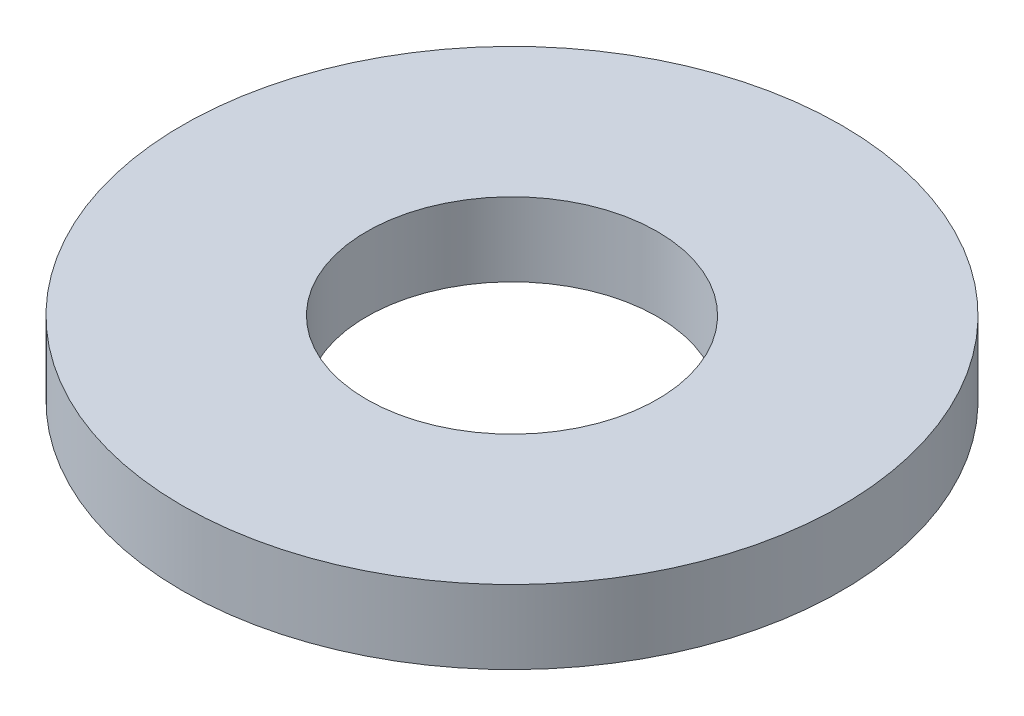
ISO-10303-21;
HEADER;
FILE_DESCRIPTION(('STEP AP214'),'2;1');
FILE_NAME('part.step','',(''),(''),'','','');
FILE_SCHEMA(('AUTOMOTIVE_DESIGN { 1 0 10303 214 1 1 1 1 }'));
ENDSEC;
DATA;
#1=APPLICATION_CONTEXT('core data for automotive mechanical design processes');
#2=APPLICATION_PROTOCOL_DEFINITION('international standard','automotive_design',2000,#1);
#3=PRODUCT_CONTEXT('',#1,'mechanical');
#4=PRODUCT('Part','Part','',(#3));
#5=PRODUCT_RELATED_PRODUCT_CATEGORY('part','',(#4));
#6=PRODUCT_DEFINITION_FORMATION('','',#4);
#7=PRODUCT_DEFINITION_CONTEXT('part definition',#1,'design');
#8=PRODUCT_DEFINITION('design','',#6,#7);
#9=PRODUCT_DEFINITION_SHAPE('','',#8);
#10=(LENGTH_UNIT() NAMED_UNIT(*) SI_UNIT(.MILLI.,.METRE.));
#11=(NAMED_UNIT(*) PLANE_ANGLE_UNIT() SI_UNIT($,.RADIAN.));
#12=(NAMED_UNIT(*) SI_UNIT($,.STERADIAN.) SOLID_ANGLE_UNIT());
#13=UNCERTAINTY_MEASURE_WITH_UNIT(LENGTH_MEASURE(1.E-05),#10,'distance_accuracy_value','');
#14=(GEOMETRIC_REPRESENTATION_CONTEXT(3) GLOBAL_UNCERTAINTY_ASSIGNED_CONTEXT((#13)) GLOBAL_UNIT_ASSIGNED_CONTEXT((#10,
#11,#12)) REPRESENTATION_CONTEXT('',''));
#15=CARTESIAN_POINT('',(0.,0.,0.));
#16=DIRECTION('',(0.,0.,1.));
#17=DIRECTION('',(1.,0.,0.));
#18=AXIS2_PLACEMENT_3D('',#15,#16,#17);
#19=CARTESIAN_POINT('',(0.,19.,0.));
#20=DIRECTION('',(0.,-1.,0.));
#21=DIRECTION('',(0.,0.,-1.));
#22=AXIS2_PLACEMENT_3D('',#19,#20,#21);
#23=CYLINDRICAL_SURFACE('',#22,85.);
#24=CARTESIAN_POINT('',(0.,19.,0.));
#25=DIRECTION('',(0.,1.,0.));
#26=DIRECTION('',(0.,0.,1.));
#27=AXIS2_PLACEMENT_3D('',#24,#25,#26);
#28=CIRCLE('',#27,85.);
#29=CARTESIAN_POINT('',(0.,19.,85.));
#30=VERTEX_POINT('',#29);
#31=EDGE_CURVE('E10',#30,#30,#28,.T.);
#32=ORIENTED_EDGE('',*,*,#31,.F.);
#33=EDGE_LOOP('',(#32));
#34=FACE_BOUND('',#33,.T.);
#35=CARTESIAN_POINT('',(0.,0.,0.));
#36=DIRECTION('',(0.,1.,0.));
#37=DIRECTION('',(0.,0.,1.));
#38=AXIS2_PLACEMENT_3D('',#35,#36,#37);
#39=CIRCLE('',#38,85.);
#40=CARTESIAN_POINT('',(0.,0.,85.));
#41=VERTEX_POINT('',#40);
#42=EDGE_CURVE('E37',#41,#41,#39,.T.);
#43=ORIENTED_EDGE('',*,*,#42,.T.);
#44=EDGE_LOOP('',(#43));
#45=FACE_BOUND('',#44,.T.);
#46=ADVANCED_FACE('F40',(#34,#45),#23,.T.);
#47=CARTESIAN_POINT('',(0.,19.,0.));
#48=DIRECTION('',(0.,1.,0.));
#49=DIRECTION('',(0.,0.,1.));
#50=AXIS2_PLACEMENT_3D('',#47,#48,#49);
#51=PLANE('',#50);
#52=CARTESIAN_POINT('',(0.,19.,0.));
#53=DIRECTION('',(0.,1.,0.));
#54=DIRECTION('',(0.,0.,1.));
#55=AXIS2_PLACEMENT_3D('',#52,#53,#54);
#56=CIRCLE('',#55,37.5);
#57=CARTESIAN_POINT('',(0.,19.,37.5));
#58=VERTEX_POINT('',#57);
#59=EDGE_CURVE('E50',#58,#58,#56,.T.);
#60=ORIENTED_EDGE('',*,*,#59,.F.);
#61=EDGE_LOOP('',(#60));
#62=FACE_BOUND('',#61,.T.);
#63=ORIENTED_EDGE('',*,*,#31,.T.);
#64=EDGE_LOOP('',(#63));
#65=FACE_BOUND('',#64,.T.);
#66=ADVANCED_FACE('F59',(#62,#65),#51,.T.);
#67=CARTESIAN_POINT('',(0.,0.,0.));
#68=DIRECTION('',(0.,1.,0.));
#69=DIRECTION('',(0.,0.,1.));
#70=AXIS2_PLACEMENT_3D('',#67,#68,#69);
#71=PLANE('',#70);
#72=CARTESIAN_POINT('',(0.,0.,0.));
#73=DIRECTION('',(0.,1.,0.));
#74=DIRECTION('',(0.,0.,1.));
#75=AXIS2_PLACEMENT_3D('',#72,#73,#74);
#76=CIRCLE('',#75,37.5);
#77=CARTESIAN_POINT('',(0.,0.,37.5));
#78=VERTEX_POINT('',#77);
#79=EDGE_CURVE('E47',#78,#78,#76,.T.);
#80=ORIENTED_EDGE('',*,*,#79,.T.);
#81=EDGE_LOOP('',(#80));
#82=FACE_BOUND('',#81,.T.);
#83=ORIENTED_EDGE('',*,*,#42,.F.);
#84=EDGE_LOOP('',(#83));
#85=FACE_BOUND('',#84,.T.);
#86=ADVANCED_FACE('F58',(#82,#85),#71,.F.);
#87=CARTESIAN_POINT('',(0.,19.,0.));
#88=DIRECTION('',(0.,-1.,0.));
#89=DIRECTION('',(0.,0.,-1.));
#90=AXIS2_PLACEMENT_3D('',#87,#88,#89);
#91=CYLINDRICAL_SURFACE('',#90,37.5);
#92=ORIENTED_EDGE('',*,*,#59,.T.);
#93=EDGE_LOOP('',(#92));
#94=FACE_BOUND('',#93,.T.);
#95=ORIENTED_EDGE('',*,*,#79,.F.);
#96=EDGE_LOOP('',(#95));
#97=FACE_BOUND('',#96,.T.);
#98=ADVANCED_FACE('F54',(#94,#97),#91,.F.);
#99=CLOSED_SHELL('',(#46,#66,#86,#98));
#100=MANIFOLD_SOLID_BREP('B2',#99);
#101=ADVANCED_BREP_SHAPE_REPRESENTATION('',(#18,#100),#14);
#102=SHAPE_DEFINITION_REPRESENTATION(#9,#101);
ENDSEC;
END-ISO-10303-21;
